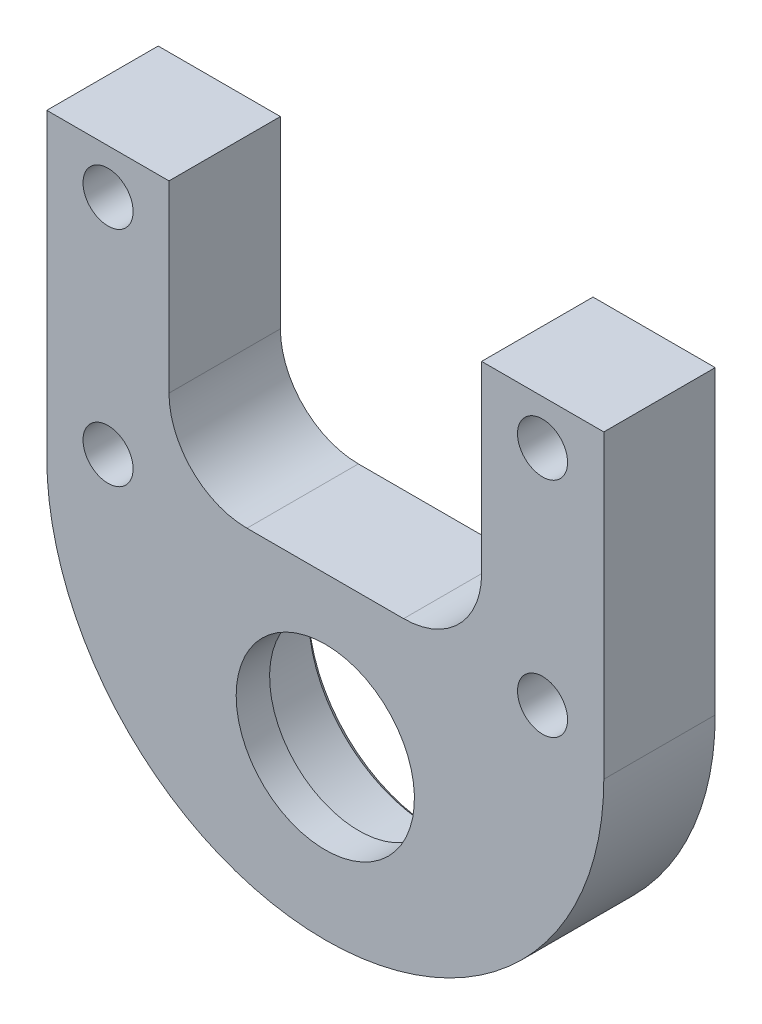
ISO-10303-21;
HEADER;
FILE_DESCRIPTION(('STEP AP214'),'2;1');
FILE_NAME('part.step','',(''),(''),'','','');
FILE_SCHEMA(('AUTOMOTIVE_DESIGN { 1 0 10303 214 1 1 1 1 }'));
ENDSEC;
DATA;
#1=APPLICATION_CONTEXT('core data for automotive mechanical design processes');
#2=APPLICATION_PROTOCOL_DEFINITION('international standard','automotive_design',2000,#1);
#3=PRODUCT_CONTEXT('',#1,'mechanical');
#4=PRODUCT('Part','Part','',(#3));
#5=PRODUCT_RELATED_PRODUCT_CATEGORY('part','',(#4));
#6=PRODUCT_DEFINITION_FORMATION('','',#4);
#7=PRODUCT_DEFINITION_CONTEXT('part definition',#1,'design');
#8=PRODUCT_DEFINITION('design','',#6,#7);
#9=PRODUCT_DEFINITION_SHAPE('','',#8);
#10=(LENGTH_UNIT() NAMED_UNIT(*) SI_UNIT(.MILLI.,.METRE.));
#11=(NAMED_UNIT(*) PLANE_ANGLE_UNIT() SI_UNIT($,.RADIAN.));
#12=(NAMED_UNIT(*) SI_UNIT($,.STERADIAN.) SOLID_ANGLE_UNIT());
#13=UNCERTAINTY_MEASURE_WITH_UNIT(LENGTH_MEASURE(1.E-05),#10,'distance_accuracy_value','');
#14=(GEOMETRIC_REPRESENTATION_CONTEXT(3) GLOBAL_UNCERTAINTY_ASSIGNED_CONTEXT((#13)) GLOBAL_UNIT_ASSIGNED_CONTEXT((#10,
#11,#12)) REPRESENTATION_CONTEXT('',''));
#15=CARTESIAN_POINT('',(0.,0.,0.));
#16=DIRECTION('',(0.,0.,1.));
#17=DIRECTION('',(1.,0.,0.));
#18=AXIS2_PLACEMENT_3D('',#15,#16,#17);
#19=CARTESIAN_POINT('',(-25.,37.,20.));
#20=DIRECTION('',(0.,-1.,0.));
#21=DIRECTION('',(1.,0.,0.));
#22=AXIS2_PLACEMENT_3D('',#19,#20,#21);
#23=PLANE('',#22);
#24=DIRECTION('',(-1.,0.,0.));
#25=VECTOR('',#24,1.);
#26=CARTESIAN_POINT('',(-25.,37.,10.));
#27=LINE('',#26,#25);
#28=CARTESIAN_POINT('',(-14.03125,37.,10.));
#29=VERTEX_POINT('',#28);
#30=CARTESIAN_POINT('',(-25.,37.,10.));
#31=VERTEX_POINT('',#30);
#32=EDGE_CURVE('E370',#29,#31,#27,.T.);
#33=ORIENTED_EDGE('',*,*,#32,.F.);
#34=DIRECTION('',(0.,0.,1.));
#35=VECTOR('',#34,1.);
#36=CARTESIAN_POINT('',(-14.03125,37.,0.));
#37=LINE('',#36,#35);
#38=CARTESIAN_POINT('',(-14.03125,37.,0.));
#39=VERTEX_POINT('',#38);
#40=EDGE_CURVE('E281',#39,#29,#37,.T.);
#41=ORIENTED_EDGE('',*,*,#40,.F.);
#42=DIRECTION('',(-1.,0.,0.));
#43=VECTOR('',#42,1.);
#44=CARTESIAN_POINT('',(-25.,37.,0.));
#45=LINE('',#44,#43);
#46=CARTESIAN_POINT('',(-25.,37.,0.));
#47=VERTEX_POINT('',#46);
#48=EDGE_CURVE('E261',#39,#47,#45,.T.);
#49=ORIENTED_EDGE('',*,*,#48,.T.);
#50=DIRECTION('',(0.,0.,-1.));
#51=VECTOR('',#50,1.);
#52=CARTESIAN_POINT('',(-25.,37.,20.));
#53=LINE('',#52,#51);
#54=EDGE_CURVE('E388',#31,#47,#53,.T.);
#55=ORIENTED_EDGE('',*,*,#54,.F.);
#56=EDGE_LOOP('',(#33,#41,#49,#55));
#57=FACE_BOUND('',#56,.T.);
#58=ADVANCED_FACE('F118',(#57),#23,.F.);
#59=CARTESIAN_POINT('',(0.,0.,0.));
#60=DIRECTION('',(0.,0.,-1.));
#61=DIRECTION('',(-1.,0.,0.));
#62=AXIS2_PLACEMENT_3D('',#59,#60,#61);
#63=PLANE('',#62);
#64=DIRECTION('',(0.,1.,0.));
#65=VECTOR('',#64,1.);
#66=CARTESIAN_POINT('',(25.,-15.,0.));
#67=LINE('',#66,#65);
#68=CARTESIAN_POINT('',(25.,10.,0.));
#69=VERTEX_POINT('',#68);
#70=CARTESIAN_POINT('',(25.,37.,0.));
#71=VERTEX_POINT('',#70);
#72=EDGE_CURVE('E383',#69,#71,#67,.T.);
#73=ORIENTED_EDGE('',*,*,#72,.F.);
#74=CARTESIAN_POINT('',(0.,10.,0.));
#75=DIRECTION('',(0.,0.,-1.));
#76=DIRECTION('',(-1.,0.,0.));
#77=AXIS2_PLACEMENT_3D('',#74,#75,#76);
#78=CIRCLE('',#77,25.);
#79=CARTESIAN_POINT('',(0.,-15.,0.));
#80=VERTEX_POINT('',#79);
#81=EDGE_CURVE('E407',#69,#80,#78,.T.);
#82=ORIENTED_EDGE('',*,*,#81,.T.);
#83=CARTESIAN_POINT('',(0.,10.,0.));
#84=DIRECTION('',(0.,0.,-1.));
#85=DIRECTION('',(-1.,0.,0.));
#86=AXIS2_PLACEMENT_3D('',#83,#84,#85);
#87=CIRCLE('',#86,25.);
#88=CARTESIAN_POINT('',(-25.,10.,0.));
#89=VERTEX_POINT('',#88);
#90=EDGE_CURVE('E405',#80,#89,#87,.T.);
#91=ORIENTED_EDGE('',*,*,#90,.T.);
#92=DIRECTION('',(0.,-1.,0.));
#93=VECTOR('',#92,1.);
#94=CARTESIAN_POINT('',(-25.,-15.,0.));
#95=LINE('',#94,#93);
#96=EDGE_CURVE('E381',#47,#89,#95,.T.);
#97=ORIENTED_EDGE('',*,*,#96,.F.);
#98=ORIENTED_EDGE('',*,*,#48,.F.);
#99=DIRECTION('',(0.,-1.,0.));
#100=VECTOR('',#99,1.);
#101=CARTESIAN_POINT('',(-14.03125,37.,0.));
#102=LINE('',#101,#100);
#103=CARTESIAN_POINT('',(-14.03125,20.5,0.));
#104=VERTEX_POINT('',#103);
#105=EDGE_CURVE('E238',#39,#104,#102,.T.);
#106=ORIENTED_EDGE('',*,*,#105,.T.);
#107=CARTESIAN_POINT('',(-7.03125000000002,20.5,0.));
#108=DIRECTION('',(0.,0.,1.));
#109=DIRECTION('',(1.,0.,0.));
#110=AXIS2_PLACEMENT_3D('',#107,#108,#109);
#111=CIRCLE('',#110,7.);
#112=CARTESIAN_POINT('',(-7.03125000000002,13.5,0.));
#113=VERTEX_POINT('',#112);
#114=EDGE_CURVE('E249',#104,#113,#111,.T.);
#115=ORIENTED_EDGE('',*,*,#114,.T.);
#116=DIRECTION('',(1.,0.,0.));
#117=VECTOR('',#116,1.);
#118=CARTESIAN_POINT('',(-7.03125000000002,13.5,0.));
#119=LINE('',#118,#117);
#120=CARTESIAN_POINT('',(7.03125000000002,13.5,0.));
#121=VERTEX_POINT('',#120);
#122=EDGE_CURVE('E254',#113,#121,#119,.T.);
#123=ORIENTED_EDGE('',*,*,#122,.T.);
#124=CARTESIAN_POINT('',(7.03125000000002,20.5,0.));
#125=DIRECTION('',(0.,0.,1.));
#126=DIRECTION('',(1.,0.,0.));
#127=AXIS2_PLACEMENT_3D('',#124,#125,#126);
#128=CIRCLE('',#127,7.);
#129=CARTESIAN_POINT('',(14.03125,20.5,0.));
#130=VERTEX_POINT('',#129);
#131=EDGE_CURVE('E268',#121,#130,#128,.T.);
#132=ORIENTED_EDGE('',*,*,#131,.T.);
#133=DIRECTION('',(0.,1.,0.));
#134=VECTOR('',#133,1.);
#135=CARTESIAN_POINT('',(14.03125,37.,0.));
#136=LINE('',#135,#134);
#137=CARTESIAN_POINT('',(14.03125,37.,0.));
#138=VERTEX_POINT('',#137);
#139=EDGE_CURVE('E246',#130,#138,#136,.T.);
#140=ORIENTED_EDGE('',*,*,#139,.T.);
#141=EDGE_CURVE('E385',#71,#138,#45,.T.);
#142=ORIENTED_EDGE('',*,*,#141,.F.);
#143=EDGE_LOOP('',(#73,#82,#91,#97,#98,#106,#115,#123,#132,#140,#142));
#144=FACE_BOUND('',#143,.T.);
#145=CARTESIAN_POINT('',(0.,0.,0.));
#146=DIRECTION('',(0.,0.,-1.));
#147=DIRECTION('',(-1.,0.,0.));
#148=AXIS2_PLACEMENT_3D('',#145,#146,#147);
#149=CIRCLE('',#148,11.5);
#150=CARTESIAN_POINT('',(-11.5,0.,0.));
#151=VERTEX_POINT('',#150);
#152=EDGE_CURVE('E399',#151,#151,#149,.F.);
#153=ORIENTED_EDGE('',*,*,#152,.T.);
#154=EDGE_LOOP('',(#153));
#155=FACE_BOUND('',#154,.T.);
#156=CARTESIAN_POINT('',(19.5,23.,0.));
#157=DIRECTION('',(0.,0.,-1.));
#158=DIRECTION('',(-1.,0.,0.));
#159=AXIS2_PLACEMENT_3D('',#156,#157,#158);
#160=CIRCLE('',#159,1.5875);
#161=CARTESIAN_POINT('',(17.9125,23.,0.));
#162=VERTEX_POINT('',#161);
#163=EDGE_CURVE('E336',#162,#162,#160,.T.);
#164=ORIENTED_EDGE('',*,*,#163,.F.);
#165=EDGE_LOOP('',(#164));
#166=FACE_BOUND('',#165,.T.);
#167=CARTESIAN_POINT('',(19.5,33.,0.));
#168=DIRECTION('',(0.,0.,1.));
#169=DIRECTION('',(1.,0.,0.));
#170=AXIS2_PLACEMENT_3D('',#167,#168,#169);
#171=CIRCLE('',#170,2.2479);
#172=CARTESIAN_POINT('',(21.7479,33.,0.));
#173=VERTEX_POINT('',#172);
#174=EDGE_CURVE('E345',#173,#173,#171,.T.);
#175=ORIENTED_EDGE('',*,*,#174,.T.);
#176=EDGE_LOOP('',(#175));
#177=FACE_BOUND('',#176,.T.);
#178=CARTESIAN_POINT('',(-19.5,33.,0.));
#179=DIRECTION('',(0.,0.,1.));
#180=DIRECTION('',(1.,0.,0.));
#181=AXIS2_PLACEMENT_3D('',#178,#179,#180);
#182=CIRCLE('',#181,2.2479);
#183=CARTESIAN_POINT('',(-17.2521,33.,0.));
#184=VERTEX_POINT('',#183);
#185=EDGE_CURVE('E351',#184,#184,#182,.T.);
#186=ORIENTED_EDGE('',*,*,#185,.T.);
#187=EDGE_LOOP('',(#186));
#188=FACE_BOUND('',#187,.T.);
#189=CARTESIAN_POINT('',(-19.5,13.,0.));
#190=DIRECTION('',(0.,0.,1.));
#191=DIRECTION('',(1.,0.,0.));
#192=AXIS2_PLACEMENT_3D('',#189,#190,#191);
#193=CIRCLE('',#192,2.2479);
#194=CARTESIAN_POINT('',(-17.2521,13.,0.));
#195=VERTEX_POINT('',#194);
#196=EDGE_CURVE('E357',#195,#195,#193,.T.);
#197=ORIENTED_EDGE('',*,*,#196,.T.);
#198=EDGE_LOOP('',(#197));
#199=FACE_BOUND('',#198,.T.);
#200=CARTESIAN_POINT('',(19.5,13.,0.));
#201=DIRECTION('',(0.,0.,1.));
#202=DIRECTION('',(1.,0.,0.));
#203=AXIS2_PLACEMENT_3D('',#200,#201,#202);
#204=CIRCLE('',#203,2.2479);
#205=CARTESIAN_POINT('',(21.7479,13.,0.));
#206=VERTEX_POINT('',#205);
#207=EDGE_CURVE('E363',#206,#206,#204,.T.);
#208=ORIENTED_EDGE('',*,*,#207,.T.);
#209=EDGE_LOOP('',(#208));
#210=FACE_BOUND('',#209,.T.);
#211=CARTESIAN_POINT('',(-19.0875,23.,0.));
#212=DIRECTION('',(0.,0.,-1.));
#213=DIRECTION('',(-1.,0.,0.));
#214=AXIS2_PLACEMENT_3D('',#211,#212,#213);
#215=CIRCLE('',#214,1.5875);
#216=CARTESIAN_POINT('',(-19.0875,24.5875,0.));
#217=VERTEX_POINT('',#216);
#218=CARTESIAN_POINT('',(-19.0875,21.4125,0.));
#219=VERTEX_POINT('',#218);
#220=EDGE_CURVE('E309',#217,#219,#215,.T.);
#221=ORIENTED_EDGE('',*,*,#220,.F.);
#222=DIRECTION('',(-1.,0.,0.));
#223=VECTOR('',#222,1.);
#224=CARTESIAN_POINT('',(-19.0875,24.5875,0.));
#225=LINE('',#224,#223);
#226=CARTESIAN_POINT('',(-19.9125,24.5875,0.));
#227=VERTEX_POINT('',#226);
#228=EDGE_CURVE('E300',#217,#227,#225,.T.);
#229=ORIENTED_EDGE('',*,*,#228,.T.);
#230=CARTESIAN_POINT('',(-19.9125,23.,0.));
#231=DIRECTION('',(0.,0.,-1.));
#232=DIRECTION('',(-1.,0.,0.));
#233=AXIS2_PLACEMENT_3D('',#230,#231,#232);
#234=CIRCLE('',#233,1.5875);
#235=CARTESIAN_POINT('',(-19.9125,21.4125,0.));
#236=VERTEX_POINT('',#235);
#237=EDGE_CURVE('E325',#236,#227,#234,.T.);
#238=ORIENTED_EDGE('',*,*,#237,.F.);
#239=DIRECTION('',(-1.,0.,0.));
#240=VECTOR('',#239,1.);
#241=CARTESIAN_POINT('',(-19.0875,21.4125,0.));
#242=LINE('',#241,#240);
#243=EDGE_CURVE('E283',#219,#236,#242,.T.);
#244=ORIENTED_EDGE('',*,*,#243,.F.);
#245=EDGE_LOOP('',(#221,#229,#238,#244));
#246=FACE_BOUND('',#245,.T.);
#247=ADVANCED_FACE('F258',(#144,#155,#166,#177,#188,#199,#210,#246),#63,.T.);
#248=CARTESIAN_POINT('',(25.,-15.,20.));
#249=DIRECTION('',(-1.,0.,0.));
#250=DIRECTION('',(0.,-1.,0.));
#251=AXIS2_PLACEMENT_3D('',#248,#249,#250);
#252=PLANE('',#251);
#253=DIRECTION('',(0.,1.,0.));
#254=VECTOR('',#253,1.);
#255=CARTESIAN_POINT('',(25.,-15.,10.));
#256=LINE('',#255,#254);
#257=CARTESIAN_POINT('',(25.,10.,10.));
#258=VERTEX_POINT('',#257);
#259=CARTESIAN_POINT('',(25.,37.,10.));
#260=VERTEX_POINT('',#259);
#261=EDGE_CURVE('E368',#258,#260,#256,.T.);
#262=ORIENTED_EDGE('',*,*,#261,.F.);
#263=DIRECTION('',(0.,0.,-1.));
#264=VECTOR('',#263,1.);
#265=CARTESIAN_POINT('',(25.,10.,20.));
#266=LINE('',#265,#264);
#267=EDGE_CURVE('E402',#258,#69,#266,.T.);
#268=ORIENTED_EDGE('',*,*,#267,.T.);
#269=ORIENTED_EDGE('',*,*,#72,.T.);
#270=DIRECTION('',(0.,0.,-1.));
#271=VECTOR('',#270,1.);
#272=CARTESIAN_POINT('',(25.,37.,20.));
#273=LINE('',#272,#271);
#274=EDGE_CURVE('E391',#260,#71,#273,.T.);
#275=ORIENTED_EDGE('',*,*,#274,.F.);
#276=EDGE_LOOP('',(#262,#268,#269,#275));
#277=FACE_BOUND('',#276,.T.);
#278=ADVANCED_FACE('F420',(#277),#252,.F.);
#279=CARTESIAN_POINT('',(-25.,-15.,20.));
#280=DIRECTION('',(1.,0.,0.));
#281=DIRECTION('',(0.,0.,-1.));
#282=AXIS2_PLACEMENT_3D('',#279,#280,#281);
#283=PLANE('',#282);
#284=ORIENTED_EDGE('',*,*,#96,.T.);
#285=DIRECTION('',(0.,0.,-1.));
#286=VECTOR('',#285,1.);
#287=CARTESIAN_POINT('',(-25.,10.,20.));
#288=LINE('',#287,#286);
#289=CARTESIAN_POINT('',(-25.,10.,10.));
#290=VERTEX_POINT('',#289);
#291=EDGE_CURVE('E14',#89,#290,#288,.F.);
#292=ORIENTED_EDGE('',*,*,#291,.T.);
#293=DIRECTION('',(0.,-1.,0.));
#294=VECTOR('',#293,1.);
#295=CARTESIAN_POINT('',(-25.,-15.,10.));
#296=LINE('',#295,#294);
#297=EDGE_CURVE('E366',#31,#290,#296,.T.);
#298=ORIENTED_EDGE('',*,*,#297,.F.);
#299=ORIENTED_EDGE('',*,*,#54,.T.);
#300=EDGE_LOOP('',(#284,#292,#298,#299));
#301=FACE_BOUND('',#300,.T.);
#302=ADVANCED_FACE('F444',(#301),#283,.F.);
#303=ORIENTED_EDGE('',*,*,#141,.T.);
#304=DIRECTION('',(0.,0.,1.));
#305=VECTOR('',#304,1.);
#306=CARTESIAN_POINT('',(14.03125,37.,0.));
#307=LINE('',#306,#305);
#308=CARTESIAN_POINT('',(14.03125,37.,10.));
#309=VERTEX_POINT('',#308);
#310=EDGE_CURVE('E284',#138,#309,#307,.T.);
#311=ORIENTED_EDGE('',*,*,#310,.T.);
#312=EDGE_CURVE('E371',#260,#309,#27,.T.);
#313=ORIENTED_EDGE('',*,*,#312,.F.);
#314=ORIENTED_EDGE('',*,*,#274,.T.);
#315=EDGE_LOOP('',(#303,#311,#313,#314));
#316=FACE_BOUND('',#315,.T.);
#317=ADVANCED_FACE('F435',(#316),#23,.F.);
#318=CARTESIAN_POINT('',(0.,0.,0.));
#319=DIRECTION('',(0.,0.,-1.));
#320=DIRECTION('',(0.,1.,0.));
#321=AXIS2_PLACEMENT_3D('',#318,#319,#320);
#322=CYLINDRICAL_SURFACE('',#321,8.);
#323=CARTESIAN_POINT('',(0.,0.,10.));
#324=DIRECTION('',(0.,0.,-1.));
#325=DIRECTION('',(-1.,0.,0.));
#326=AXIS2_PLACEMENT_3D('',#323,#324,#325);
#327=CIRCLE('',#326,8.);
#328=CARTESIAN_POINT('',(-8.,0.,10.));
#329=VERTEX_POINT('',#328);
#330=EDGE_CURVE('E374',#329,#329,#327,.F.);
#331=ORIENTED_EDGE('',*,*,#330,.T.);
#332=EDGE_LOOP('',(#331));
#333=FACE_BOUND('',#332,.T.);
#334=CARTESIAN_POINT('',(0.,0.,7.));
#335=DIRECTION('',(0.,0.,-1.));
#336=DIRECTION('',(0.,1.,0.));
#337=AXIS2_PLACEMENT_3D('',#334,#335,#336);
#338=CIRCLE('',#337,8.);
#339=CARTESIAN_POINT('',(0.,8.,7.));
#340=VERTEX_POINT('',#339);
#341=EDGE_CURVE('E378',#340,#340,#338,.T.);
#342=ORIENTED_EDGE('',*,*,#341,.T.);
#343=EDGE_LOOP('',(#342));
#344=FACE_BOUND('',#343,.T.);
#345=ADVANCED_FACE('F443',(#333,#344),#322,.F.);
#346=CARTESIAN_POINT('',(0.,8.,7.));
#347=DIRECTION('',(0.,0.,1.));
#348=DIRECTION('',(0.,-1.,0.));
#349=AXIS2_PLACEMENT_3D('',#346,#347,#348);
#350=PLANE('',#349);
#351=ORIENTED_EDGE('',*,*,#341,.F.);
#352=EDGE_LOOP('',(#351));
#353=FACE_BOUND('',#352,.T.);
#354=CARTESIAN_POINT('',(0.,0.,7.));
#355=DIRECTION('',(0.,0.,-1.));
#356=DIRECTION('',(0.,1.,0.));
#357=AXIS2_PLACEMENT_3D('',#354,#355,#356);
#358=CIRCLE('',#357,11.);
#359=CARTESIAN_POINT('',(0.,11.,7.));
#360=VERTEX_POINT('',#359);
#361=EDGE_CURVE('E375',#360,#360,#358,.T.);
#362=ORIENTED_EDGE('',*,*,#361,.T.);
#363=EDGE_LOOP('',(#362));
#364=FACE_BOUND('',#363,.T.);
#365=ADVANCED_FACE('F450',(#353,#364),#350,.F.);
#366=CARTESIAN_POINT('',(0.,0.,0.));
#367=DIRECTION('',(0.,0.,-1.));
#368=DIRECTION('',(0.,1.,0.));
#369=AXIS2_PLACEMENT_3D('',#366,#367,#368);
#370=CYLINDRICAL_SURFACE('',#369,11.);
#371=CARTESIAN_POINT('',(0.,0.,0.499999999999992));
#372=DIRECTION('',(0.,0.,-1.));
#373=DIRECTION('',(0.,1.,0.));
#374=AXIS2_PLACEMENT_3D('',#371,#372,#373);
#375=CIRCLE('',#374,11.);
#376=CARTESIAN_POINT('',(0.,11.,0.499999999999993));
#377=VERTEX_POINT('',#376);
#378=EDGE_CURVE('E394',#377,#377,#375,.T.);
#379=ORIENTED_EDGE('',*,*,#378,.T.);
#380=EDGE_LOOP('',(#379));
#381=FACE_BOUND('',#380,.T.);
#382=ORIENTED_EDGE('',*,*,#361,.F.);
#383=EDGE_LOOP('',(#382));
#384=FACE_BOUND('',#383,.T.);
#385=ADVANCED_FACE('F534',(#381,#384),#370,.F.);
#386=CARTESIAN_POINT('',(0.,0.,10.));
#387=DIRECTION('',(0.,0.,-1.));
#388=DIRECTION('',(-1.,0.,0.));
#389=AXIS2_PLACEMENT_3D('',#386,#387,#388);
#390=PLANE('',#389);
#391=CARTESIAN_POINT('',(19.5,33.,10.));
#392=DIRECTION('',(0.,0.,1.));
#393=DIRECTION('',(1.,0.,0.));
#394=AXIS2_PLACEMENT_3D('',#391,#392,#393);
#395=CIRCLE('',#394,2.2479);
#396=CARTESIAN_POINT('',(21.7479,33.,10.));
#397=VERTEX_POINT('',#396);
#398=EDGE_CURVE('E342',#397,#397,#395,.T.);
#399=ORIENTED_EDGE('',*,*,#398,.F.);
#400=EDGE_LOOP('',(#399));
#401=FACE_BOUND('',#400,.T.);
#402=CARTESIAN_POINT('',(-19.5,33.,10.));
#403=DIRECTION('',(0.,0.,1.));
#404=DIRECTION('',(1.,0.,0.));
#405=AXIS2_PLACEMENT_3D('',#402,#403,#404);
#406=CIRCLE('',#405,2.2479);
#407=CARTESIAN_POINT('',(-17.2521,33.,10.));
#408=VERTEX_POINT('',#407);
#409=EDGE_CURVE('E348',#408,#408,#406,.T.);
#410=ORIENTED_EDGE('',*,*,#409,.F.);
#411=EDGE_LOOP('',(#410));
#412=FACE_BOUND('',#411,.T.);
#413=CARTESIAN_POINT('',(-19.5,13.,10.));
#414=DIRECTION('',(0.,0.,1.));
#415=DIRECTION('',(1.,0.,0.));
#416=AXIS2_PLACEMENT_3D('',#413,#414,#415);
#417=CIRCLE('',#416,2.2479);
#418=CARTESIAN_POINT('',(-17.2521,13.,10.));
#419=VERTEX_POINT('',#418);
#420=EDGE_CURVE('E354',#419,#419,#417,.T.);
#421=ORIENTED_EDGE('',*,*,#420,.F.);
#422=EDGE_LOOP('',(#421));
#423=FACE_BOUND('',#422,.T.);
#424=CARTESIAN_POINT('',(19.5,13.,10.));
#425=DIRECTION('',(0.,0.,1.));
#426=DIRECTION('',(1.,0.,0.));
#427=AXIS2_PLACEMENT_3D('',#424,#425,#426);
#428=CIRCLE('',#427,2.2479);
#429=CARTESIAN_POINT('',(21.7479,13.,10.));
#430=VERTEX_POINT('',#429);
#431=EDGE_CURVE('E360',#430,#430,#428,.T.);
#432=ORIENTED_EDGE('',*,*,#431,.F.);
#433=EDGE_LOOP('',(#432));
#434=FACE_BOUND('',#433,.T.);
#435=CARTESIAN_POINT('',(0.,10.,10.));
#436=DIRECTION('',(0.,0.,-1.));
#437=DIRECTION('',(-1.,0.,0.));
#438=AXIS2_PLACEMENT_3D('',#435,#436,#437);
#439=CIRCLE('',#438,25.);
#440=CARTESIAN_POINT('',(0.,-15.,10.));
#441=VERTEX_POINT('',#440);
#442=EDGE_CURVE('E134',#290,#441,#439,.F.);
#443=ORIENTED_EDGE('',*,*,#442,.T.);
#444=CARTESIAN_POINT('',(0.,10.,10.));
#445=DIRECTION('',(0.,0.,-1.));
#446=DIRECTION('',(-1.,0.,0.));
#447=AXIS2_PLACEMENT_3D('',#444,#445,#446);
#448=CIRCLE('',#447,25.);
#449=EDGE_CURVE('E127',#441,#258,#448,.F.);
#450=ORIENTED_EDGE('',*,*,#449,.T.);
#451=ORIENTED_EDGE('',*,*,#261,.T.);
#452=ORIENTED_EDGE('',*,*,#312,.T.);
#453=DIRECTION('',(0.,1.,0.));
#454=VECTOR('',#453,1.);
#455=CARTESIAN_POINT('',(14.03125,37.,10.));
#456=LINE('',#455,#454);
#457=CARTESIAN_POINT('',(14.03125,20.5,10.));
#458=VERTEX_POINT('',#457);
#459=EDGE_CURVE('E262',#458,#309,#456,.T.);
#460=ORIENTED_EDGE('',*,*,#459,.F.);
#461=CARTESIAN_POINT('',(7.03125000000002,20.5,10.));
#462=DIRECTION('',(0.,0.,1.));
#463=DIRECTION('',(1.,0.,0.));
#464=AXIS2_PLACEMENT_3D('',#461,#462,#463);
#465=CIRCLE('',#464,7.);
#466=CARTESIAN_POINT('',(7.03125000000002,13.5,10.));
#467=VERTEX_POINT('',#466);
#468=EDGE_CURVE('E264',#467,#458,#465,.T.);
#469=ORIENTED_EDGE('',*,*,#468,.F.);
#470=DIRECTION('',(1.,0.,0.));
#471=VECTOR('',#470,1.);
#472=CARTESIAN_POINT('',(-7.03125000000002,13.5,10.));
#473=LINE('',#472,#471);
#474=CARTESIAN_POINT('',(-7.03125000000002,13.5,10.));
#475=VERTEX_POINT('',#474);
#476=EDGE_CURVE('E276',#475,#467,#473,.T.);
#477=ORIENTED_EDGE('',*,*,#476,.F.);
#478=CARTESIAN_POINT('',(-7.03125000000002,20.5,10.));
#479=DIRECTION('',(0.,0.,1.));
#480=DIRECTION('',(1.,0.,0.));
#481=AXIS2_PLACEMENT_3D('',#478,#479,#480);
#482=CIRCLE('',#481,7.);
#483=CARTESIAN_POINT('',(-14.03125,20.5,10.));
#484=VERTEX_POINT('',#483);
#485=EDGE_CURVE('E274',#484,#475,#482,.T.);
#486=ORIENTED_EDGE('',*,*,#485,.F.);
#487=DIRECTION('',(0.,-1.,0.));
#488=VECTOR('',#487,1.);
#489=CARTESIAN_POINT('',(-14.03125,37.,10.));
#490=LINE('',#489,#488);
#491=EDGE_CURVE('E241',#29,#484,#490,.T.);
#492=ORIENTED_EDGE('',*,*,#491,.F.);
#493=ORIENTED_EDGE('',*,*,#32,.T.);
#494=ORIENTED_EDGE('',*,*,#297,.T.);
#495=EDGE_LOOP('',(#443,#450,#451,#452,#460,#469,#477,#486,#492,#493,#494));
#496=FACE_BOUND('',#495,.T.);
#497=ORIENTED_EDGE('',*,*,#330,.F.);
#498=EDGE_LOOP('',(#497));
#499=FACE_BOUND('',#498,.T.);
#500=ADVANCED_FACE('F412',(#401,#412,#423,#434,#496,#499),#390,.F.);
#501=CARTESIAN_POINT('',(19.5,13.,10.));
#502=DIRECTION('',(0.,0.,1.));
#503=DIRECTION('',(1.,0.,0.));
#504=AXIS2_PLACEMENT_3D('',#501,#502,#503);
#505=CYLINDRICAL_SURFACE('',#504,2.2479);
#506=ORIENTED_EDGE('',*,*,#207,.F.);
#507=EDGE_LOOP('',(#506));
#508=FACE_BOUND('',#507,.T.);
#509=ORIENTED_EDGE('',*,*,#431,.T.);
#510=EDGE_LOOP('',(#509));
#511=FACE_BOUND('',#510,.T.);
#512=ADVANCED_FACE('F527',(#508,#511),#505,.F.);
#513=CARTESIAN_POINT('',(-19.5,13.,10.));
#514=DIRECTION('',(0.,0.,1.));
#515=DIRECTION('',(1.,0.,0.));
#516=AXIS2_PLACEMENT_3D('',#513,#514,#515);
#517=CYLINDRICAL_SURFACE('',#516,2.2479);
#518=ORIENTED_EDGE('',*,*,#196,.F.);
#519=EDGE_LOOP('',(#518));
#520=FACE_BOUND('',#519,.T.);
#521=ORIENTED_EDGE('',*,*,#420,.T.);
#522=EDGE_LOOP('',(#521));
#523=FACE_BOUND('',#522,.T.);
#524=ADVANCED_FACE('F523',(#520,#523),#517,.F.);
#525=CARTESIAN_POINT('',(-19.5,33.,10.));
#526=DIRECTION('',(0.,0.,1.));
#527=DIRECTION('',(1.,0.,0.));
#528=AXIS2_PLACEMENT_3D('',#525,#526,#527);
#529=CYLINDRICAL_SURFACE('',#528,2.2479);
#530=ORIENTED_EDGE('',*,*,#185,.F.);
#531=EDGE_LOOP('',(#530));
#532=FACE_BOUND('',#531,.T.);
#533=ORIENTED_EDGE('',*,*,#409,.T.);
#534=EDGE_LOOP('',(#533));
#535=FACE_BOUND('',#534,.T.);
#536=ADVANCED_FACE('F519',(#532,#535),#529,.F.);
#537=CARTESIAN_POINT('',(19.5,33.,10.));
#538=DIRECTION('',(0.,0.,1.));
#539=DIRECTION('',(1.,0.,0.));
#540=AXIS2_PLACEMENT_3D('',#537,#538,#539);
#541=CYLINDRICAL_SURFACE('',#540,2.2479);
#542=ORIENTED_EDGE('',*,*,#174,.F.);
#543=EDGE_LOOP('',(#542));
#544=FACE_BOUND('',#543,.T.);
#545=ORIENTED_EDGE('',*,*,#398,.T.);
#546=EDGE_LOOP('',(#545));
#547=FACE_BOUND('',#546,.T.);
#548=ADVANCED_FACE('F515',(#544,#547),#541,.F.);
#549=CARTESIAN_POINT('',(19.5,23.,5.));
#550=DIRECTION('',(0.,0.,-1.));
#551=DIRECTION('',(-1.,0.,0.));
#552=AXIS2_PLACEMENT_3D('',#549,#550,#551);
#553=CONICAL_SURFACE('',#552,1.5875,1.02974425867665);
#554=CARTESIAN_POINT('',(19.5,23.,5.95386623270625));
#555=VERTEX_POINT('',#554);
#556=VERTEX_LOOP('',#555);
#557=FACE_BOUND('',#556,.T.);
#558=CARTESIAN_POINT('',(19.5,23.,5.));
#559=DIRECTION('',(0.,0.,-1.));
#560=DIRECTION('',(-1.,0.,0.));
#561=AXIS2_PLACEMENT_3D('',#558,#559,#560);
#562=CIRCLE('',#561,1.5875);
#563=CARTESIAN_POINT('',(17.9125,23.,5.));
#564=VERTEX_POINT('',#563);
#565=EDGE_CURVE('E339',#564,#564,#562,.T.);
#566=ORIENTED_EDGE('',*,*,#565,.T.);
#567=EDGE_LOOP('',(#566));
#568=FACE_BOUND('',#567,.T.);
#569=ADVANCED_FACE('F511',(#557,#568),#553,.F.);
#570=CARTESIAN_POINT('',(19.5,23.,0.));
#571=DIRECTION('',(0.,0.,-1.));
#572=DIRECTION('',(-1.,0.,0.));
#573=AXIS2_PLACEMENT_3D('',#570,#571,#572);
#574=CYLINDRICAL_SURFACE('',#573,1.5875);
#575=ORIENTED_EDGE('',*,*,#565,.F.);
#576=EDGE_LOOP('',(#575));
#577=FACE_BOUND('',#576,.T.);
#578=ORIENTED_EDGE('',*,*,#163,.T.);
#579=EDGE_LOOP('',(#578));
#580=FACE_BOUND('',#579,.T.);
#581=ADVANCED_FACE('F507',(#577,#580),#574,.F.);
#582=CARTESIAN_POINT('',(-19.9125,23.,5.));
#583=DIRECTION('',(0.,0.,-1.));
#584=DIRECTION('',(-1.,0.,0.));
#585=AXIS2_PLACEMENT_3D('',#582,#583,#584);
#586=CONICAL_SURFACE('',#585,1.5875,1.02974425867665);
#587=CARTESIAN_POINT('',(-19.9125,23.,5.));
#588=DIRECTION('',(0.,0.,-1.));
#589=DIRECTION('',(-1.,0.,0.));
#590=AXIS2_PLACEMENT_3D('',#587,#588,#589);
#591=CIRCLE('',#590,1.5875);
#592=CARTESIAN_POINT('',(-19.9125,21.4125,5.));
#593=VERTEX_POINT('',#592);
#594=CARTESIAN_POINT('',(-19.9125,24.5875,5.));
#595=VERTEX_POINT('',#594);
#596=EDGE_CURVE('E328',#593,#595,#591,.T.);
#597=ORIENTED_EDGE('',*,*,#596,.T.);
#598=DIRECTION('',(0.,-0.857167300702112,0.515038074910054));
#599=VECTOR('',#598,1.);
#600=CARTESIAN_POINT('',(-19.9125,23.,5.95386623270625));
#601=LINE('',#600,#599);
#602=CARTESIAN_POINT('',(-19.9125,23.,5.95386623270625));
#603=VERTEX_POINT('',#602);
#604=EDGE_CURVE('E319',#603,#595,#601,.F.);
#605=ORIENTED_EDGE('',*,*,#604,.F.);
#606=DIRECTION('',(0.,-0.857167300702112,-0.515038074910054));
#607=VECTOR('',#606,1.);
#608=CARTESIAN_POINT('',(-19.9125,23.,5.95386623270625));
#609=LINE('',#608,#607);
#610=EDGE_CURVE('E322',#593,#603,#609,.F.);
#611=ORIENTED_EDGE('',*,*,#610,.F.);
#612=EDGE_LOOP('',(#597,#605,#611));
#613=FACE_BOUND('',#612,.T.);
#614=ADVANCED_FACE('F503',(#613),#586,.F.);
#615=CARTESIAN_POINT('',(-19.9125,23.,0.));
#616=DIRECTION('',(0.,0.,-1.));
#617=DIRECTION('',(-1.,0.,0.));
#618=AXIS2_PLACEMENT_3D('',#615,#616,#617);
#619=CYLINDRICAL_SURFACE('',#618,1.5875);
#620=ORIENTED_EDGE('',*,*,#237,.T.);
#621=DIRECTION('',(0.,0.,-1.));
#622=VECTOR('',#621,1.);
#623=CARTESIAN_POINT('',(-19.9125,24.5875,0.));
#624=LINE('',#623,#622);
#625=EDGE_CURVE('E331',#595,#227,#624,.T.);
#626=ORIENTED_EDGE('',*,*,#625,.F.);
#627=ORIENTED_EDGE('',*,*,#596,.F.);
#628=DIRECTION('',(0.,0.,-1.));
#629=VECTOR('',#628,1.);
#630=CARTESIAN_POINT('',(-19.9125,21.4125,0.));
#631=LINE('',#630,#629);
#632=EDGE_CURVE('E333',#236,#593,#631,.F.);
#633=ORIENTED_EDGE('',*,*,#632,.F.);
#634=EDGE_LOOP('',(#620,#626,#627,#633));
#635=FACE_BOUND('',#634,.T.);
#636=ADVANCED_FACE('F499',(#635),#619,.F.);
#637=CARTESIAN_POINT('',(-19.0875,23.,5.));
#638=DIRECTION('',(0.,0.,-1.));
#639=DIRECTION('',(-1.,0.,0.));
#640=AXIS2_PLACEMENT_3D('',#637,#638,#639);
#641=CONICAL_SURFACE('',#640,1.5875,1.02974425867665);
#642=CARTESIAN_POINT('',(-19.0875,23.,5.));
#643=DIRECTION('',(0.,0.,-1.));
#644=DIRECTION('',(-1.,0.,0.));
#645=AXIS2_PLACEMENT_3D('',#642,#643,#644);
#646=CIRCLE('',#645,1.5875);
#647=CARTESIAN_POINT('',(-19.0875,24.5875,5.));
#648=VERTEX_POINT('',#647);
#649=CARTESIAN_POINT('',(-19.0875,21.4125,5.));
#650=VERTEX_POINT('',#649);
#651=EDGE_CURVE('E311',#648,#650,#646,.T.);
#652=ORIENTED_EDGE('',*,*,#651,.T.);
#653=DIRECTION('',(0.,0.857167300702112,0.515038074910054));
#654=VECTOR('',#653,1.);
#655=CARTESIAN_POINT('',(-19.0875,23.,5.95386623270625));
#656=LINE('',#655,#654);
#657=CARTESIAN_POINT('',(-19.0875,23.,5.95386623270625));
#658=VERTEX_POINT('',#657);
#659=EDGE_CURVE('E303',#658,#650,#656,.F.);
#660=ORIENTED_EDGE('',*,*,#659,.F.);
#661=DIRECTION('',(0.,0.857167300702112,-0.515038074910054));
#662=VECTOR('',#661,1.);
#663=CARTESIAN_POINT('',(-19.0875,23.,5.95386623270625));
#664=LINE('',#663,#662);
#665=EDGE_CURVE('E306',#648,#658,#664,.F.);
#666=ORIENTED_EDGE('',*,*,#665,.F.);
#667=EDGE_LOOP('',(#652,#660,#666));
#668=FACE_BOUND('',#667,.T.);
#669=ADVANCED_FACE('F495',(#668),#641,.F.);
#670=CARTESIAN_POINT('',(-19.0875,23.,0.));
#671=DIRECTION('',(0.,0.,-1.));
#672=DIRECTION('',(-1.,0.,0.));
#673=AXIS2_PLACEMENT_3D('',#670,#671,#672);
#674=CYLINDRICAL_SURFACE('',#673,1.5875);
#675=ORIENTED_EDGE('',*,*,#220,.T.);
#676=DIRECTION('',(0.,0.,-1.));
#677=VECTOR('',#676,1.);
#678=CARTESIAN_POINT('',(-19.0875,21.4125,0.));
#679=LINE('',#678,#677);
#680=EDGE_CURVE('E313',#650,#219,#679,.T.);
#681=ORIENTED_EDGE('',*,*,#680,.F.);
#682=ORIENTED_EDGE('',*,*,#651,.F.);
#683=DIRECTION('',(0.,0.,-1.));
#684=VECTOR('',#683,1.);
#685=CARTESIAN_POINT('',(-19.0875,24.5875,0.));
#686=LINE('',#685,#684);
#687=EDGE_CURVE('E316',#217,#648,#686,.F.);
#688=ORIENTED_EDGE('',*,*,#687,.F.);
#689=EDGE_LOOP('',(#675,#681,#682,#688));
#690=FACE_BOUND('',#689,.T.);
#691=ADVANCED_FACE('F491',(#690),#674,.F.);
#692=CARTESIAN_POINT('',(-19.0875,24.5875,0.));
#693=DIRECTION('',(0.,1.,0.));
#694=DIRECTION('',(0.,0.,1.));
#695=AXIS2_PLACEMENT_3D('',#692,#693,#694);
#696=PLANE('',#695);
#697=ORIENTED_EDGE('',*,*,#625,.T.);
#698=ORIENTED_EDGE('',*,*,#228,.F.);
#699=ORIENTED_EDGE('',*,*,#687,.T.);
#700=DIRECTION('',(-1.,0.,0.));
#701=VECTOR('',#700,1.);
#702=CARTESIAN_POINT('',(-19.0875,24.5875,5.));
#703=LINE('',#702,#701);
#704=EDGE_CURVE('E298',#648,#595,#703,.T.);
#705=ORIENTED_EDGE('',*,*,#704,.T.);
#706=EDGE_LOOP('',(#697,#698,#699,#705));
#707=FACE_BOUND('',#706,.T.);
#708=ADVANCED_FACE('F487',(#707),#696,.F.);
#709=CARTESIAN_POINT('',(-19.0875,23.,5.95386623270625));
#710=DIRECTION('',(0.,0.515038074910055,0.857167300702112));
#711=DIRECTION('',(0.,-0.857167300702112,0.515038074910055));
#712=AXIS2_PLACEMENT_3D('',#709,#710,#711);
#713=PLANE('',#712);
#714=ORIENTED_EDGE('',*,*,#604,.T.);
#715=ORIENTED_EDGE('',*,*,#704,.F.);
#716=ORIENTED_EDGE('',*,*,#665,.T.);
#717=DIRECTION('',(-1.,0.,0.));
#718=VECTOR('',#717,1.);
#719=CARTESIAN_POINT('',(-19.0875,23.,5.95386623270625));
#720=LINE('',#719,#718);
#721=EDGE_CURVE('E296',#658,#603,#720,.T.);
#722=ORIENTED_EDGE('',*,*,#721,.T.);
#723=EDGE_LOOP('',(#714,#715,#716,#722));
#724=FACE_BOUND('',#723,.T.);
#725=ADVANCED_FACE('F483',(#724),#713,.F.);
#726=CARTESIAN_POINT('',(-19.0875,23.,5.95386623270625));
#727=DIRECTION('',(0.,-0.515038074910055,0.857167300702112));
#728=DIRECTION('',(0.,-0.857167300702112,-0.515038074910055));
#729=AXIS2_PLACEMENT_3D('',#726,#727,#728);
#730=PLANE('',#729);
#731=ORIENTED_EDGE('',*,*,#610,.T.);
#732=ORIENTED_EDGE('',*,*,#721,.F.);
#733=ORIENTED_EDGE('',*,*,#659,.T.);
#734=DIRECTION('',(-1.,0.,0.));
#735=VECTOR('',#734,1.);
#736=CARTESIAN_POINT('',(-19.0875,21.4125,5.));
#737=LINE('',#736,#735);
#738=EDGE_CURVE('E293',#650,#593,#737,.T.);
#739=ORIENTED_EDGE('',*,*,#738,.T.);
#740=EDGE_LOOP('',(#731,#732,#733,#739));
#741=FACE_BOUND('',#740,.T.);
#742=ADVANCED_FACE('F479',(#741),#730,.F.);
#743=CARTESIAN_POINT('',(-19.0875,21.4125,0.));
#744=DIRECTION('',(0.,-1.,0.));
#745=DIRECTION('',(0.,0.,-1.));
#746=AXIS2_PLACEMENT_3D('',#743,#744,#745);
#747=PLANE('',#746);
#748=ORIENTED_EDGE('',*,*,#632,.T.);
#749=ORIENTED_EDGE('',*,*,#738,.F.);
#750=ORIENTED_EDGE('',*,*,#680,.T.);
#751=ORIENTED_EDGE('',*,*,#243,.T.);
#752=EDGE_LOOP('',(#748,#749,#750,#751));
#753=FACE_BOUND('',#752,.T.);
#754=ADVANCED_FACE('F476',(#753),#747,.F.);
#755=CARTESIAN_POINT('',(0.,0.,0.499999999999992));
#756=DIRECTION('',(0.,0.,-1.));
#757=DIRECTION('',(0.,1.,0.));
#758=AXIS2_PLACEMENT_3D('',#755,#756,#757);
#759=CONICAL_SURFACE('',#758,11.,0.785398163397452);
#760=ORIENTED_EDGE('',*,*,#152,.F.);
#761=EDGE_LOOP('',(#760));
#762=FACE_BOUND('',#761,.T.);
#763=ORIENTED_EDGE('',*,*,#378,.F.);
#764=EDGE_LOOP('',(#763));
#765=FACE_BOUND('',#764,.T.);
#766=ADVANCED_FACE('F475',(#762,#765),#759,.F.);
#767=CARTESIAN_POINT('',(-14.03125,37.,0.));
#768=DIRECTION('',(-1.,0.,0.));
#769=DIRECTION('',(0.,-1.,0.));
#770=AXIS2_PLACEMENT_3D('',#767,#768,#769);
#771=PLANE('',#770);
#772=ORIENTED_EDGE('',*,*,#491,.T.);
#773=DIRECTION('',(0.,0.,1.));
#774=VECTOR('',#773,1.);
#775=CARTESIAN_POINT('',(-14.03125,20.5,0.));
#776=LINE('',#775,#774);
#777=EDGE_CURVE('E234',#104,#484,#776,.T.);
#778=ORIENTED_EDGE('',*,*,#777,.F.);
#779=ORIENTED_EDGE('',*,*,#105,.F.);
#780=ORIENTED_EDGE('',*,*,#40,.T.);
#781=EDGE_LOOP('',(#772,#778,#779,#780));
#782=FACE_BOUND('',#781,.T.);
#783=ADVANCED_FACE('F236',(#782),#771,.F.);
#784=CARTESIAN_POINT('',(14.03125,37.,0.));
#785=DIRECTION('',(1.,0.,0.));
#786=DIRECTION('',(0.,0.,-1.));
#787=AXIS2_PLACEMENT_3D('',#784,#785,#786);
#788=PLANE('',#787);
#789=ORIENTED_EDGE('',*,*,#459,.T.);
#790=ORIENTED_EDGE('',*,*,#310,.F.);
#791=ORIENTED_EDGE('',*,*,#139,.F.);
#792=DIRECTION('',(0.,0.,1.));
#793=VECTOR('',#792,1.);
#794=CARTESIAN_POINT('',(14.03125,20.5,0.));
#795=LINE('',#794,#793);
#796=EDGE_CURVE('E287',#130,#458,#795,.T.);
#797=ORIENTED_EDGE('',*,*,#796,.T.);
#798=EDGE_LOOP('',(#789,#790,#791,#797));
#799=FACE_BOUND('',#798,.T.);
#800=ADVANCED_FACE('F457',(#799),#788,.F.);
#801=CARTESIAN_POINT('',(7.03125000000002,20.5,0.));
#802=DIRECTION('',(0.,0.,1.));
#803=DIRECTION('',(1.,0.,0.));
#804=AXIS2_PLACEMENT_3D('',#801,#802,#803);
#805=CYLINDRICAL_SURFACE('',#804,7.);
#806=ORIENTED_EDGE('',*,*,#468,.T.);
#807=ORIENTED_EDGE('',*,*,#796,.F.);
#808=ORIENTED_EDGE('',*,*,#131,.F.);
#809=DIRECTION('',(0.,0.,1.));
#810=VECTOR('',#809,1.);
#811=CARTESIAN_POINT('',(7.03125000000002,13.5,0.));
#812=LINE('',#811,#810);
#813=EDGE_CURVE('E289',#121,#467,#812,.T.);
#814=ORIENTED_EDGE('',*,*,#813,.T.);
#815=EDGE_LOOP('',(#806,#807,#808,#814));
#816=FACE_BOUND('',#815,.T.);
#817=ADVANCED_FACE('F462',(#816),#805,.F.);
#818=CARTESIAN_POINT('',(-7.03125000000002,13.5,0.));
#819=DIRECTION('',(0.,-1.,0.));
#820=DIRECTION('',(1.,0.,0.));
#821=AXIS2_PLACEMENT_3D('',#818,#819,#820);
#822=PLANE('',#821);
#823=ORIENTED_EDGE('',*,*,#476,.T.);
#824=ORIENTED_EDGE('',*,*,#813,.F.);
#825=ORIENTED_EDGE('',*,*,#122,.F.);
#826=DIRECTION('',(0.,0.,1.));
#827=VECTOR('',#826,1.);
#828=CARTESIAN_POINT('',(-7.03125000000002,13.5,0.));
#829=LINE('',#828,#827);
#830=EDGE_CURVE('E245',#113,#475,#829,.T.);
#831=ORIENTED_EDGE('',*,*,#830,.T.);
#832=EDGE_LOOP('',(#823,#824,#825,#831));
#833=FACE_BOUND('',#832,.T.);
#834=ADVANCED_FACE('F430',(#833),#822,.F.);
#835=CARTESIAN_POINT('',(-7.03125000000002,20.5,0.));
#836=DIRECTION('',(0.,0.,1.));
#837=DIRECTION('',(1.,0.,0.));
#838=AXIS2_PLACEMENT_3D('',#835,#836,#837);
#839=CYLINDRICAL_SURFACE('',#838,7.);
#840=ORIENTED_EDGE('',*,*,#485,.T.);
#841=ORIENTED_EDGE('',*,*,#830,.F.);
#842=ORIENTED_EDGE('',*,*,#114,.F.);
#843=ORIENTED_EDGE('',*,*,#777,.T.);
#844=EDGE_LOOP('',(#840,#841,#842,#843));
#845=FACE_BOUND('',#844,.T.);
#846=ADVANCED_FACE('F250',(#845),#839,.F.);
#847=CARTESIAN_POINT('',(0.,10.,20.));
#848=DIRECTION('',(0.,0.,-1.));
#849=DIRECTION('',(-1.,0.,0.));
#850=AXIS2_PLACEMENT_3D('',#847,#848,#849);
#851=CYLINDRICAL_SURFACE('',#850,25.);
#852=DIRECTION('',(0.,0.,-1.));
#853=VECTOR('',#852,1.);
#854=CARTESIAN_POINT('',(0.,-15.,20.));
#855=LINE('',#854,#853);
#856=EDGE_CURVE('E122',#441,#80,#855,.T.);
#857=ORIENTED_EDGE('',*,*,#856,.F.);
#858=ORIENTED_EDGE('',*,*,#442,.F.);
#859=ORIENTED_EDGE('',*,*,#291,.F.);
#860=ORIENTED_EDGE('',*,*,#90,.F.);
#861=EDGE_LOOP('',(#857,#858,#859,#860));
#862=FACE_BOUND('',#861,.T.);
#863=ADVANCED_FACE('F120',(#862),#851,.T.);
#864=CARTESIAN_POINT('',(0.,10.,20.));
#865=DIRECTION('',(0.,0.,-1.));
#866=DIRECTION('',(-1.,0.,0.));
#867=AXIS2_PLACEMENT_3D('',#864,#865,#866);
#868=CYLINDRICAL_SURFACE('',#867,25.);
#869=ORIENTED_EDGE('',*,*,#449,.F.);
#870=ORIENTED_EDGE('',*,*,#856,.T.);
#871=ORIENTED_EDGE('',*,*,#81,.F.);
#872=ORIENTED_EDGE('',*,*,#267,.F.);
#873=EDGE_LOOP('',(#869,#870,#871,#872));
#874=FACE_BOUND('',#873,.T.);
#875=ADVANCED_FACE('F421',(#874),#868,.T.);
#876=CLOSED_SHELL('',(#58,#247,#278,#302,#317,#345,#365,#385,#500,#512,#524,#536,#548,#569,#581,
#614,#636,#669,#691,#708,#725,#742,#754,#766,#783,#800,#817,#834,#846,#863,#875));
#877=MANIFOLD_SOLID_BREP('B2',#876);
#878=ADVANCED_BREP_SHAPE_REPRESENTATION('',(#18,#877),#14);
#879=SHAPE_DEFINITION_REPRESENTATION(#9,#878);
ENDSEC;
END-ISO-10303-21;
